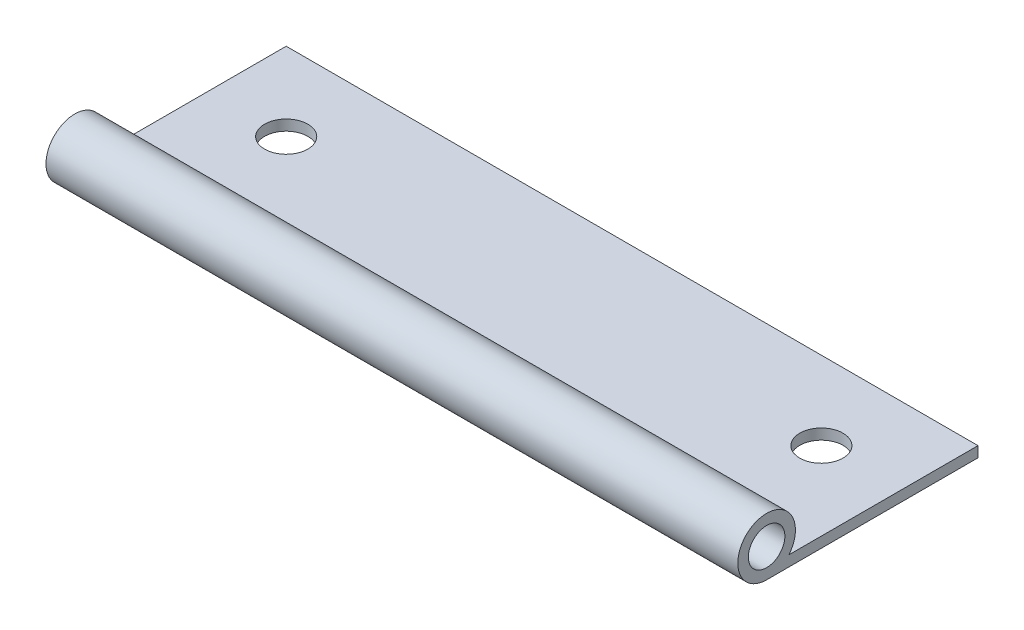
ISO-10303-21;
HEADER;
FILE_DESCRIPTION(('STEP AP214'),'2;1');
FILE_NAME('part.step','',(''),(''),'','','');
FILE_SCHEMA(('AUTOMOTIVE_DESIGN { 1 0 10303 214 1 1 1 1 }'));
ENDSEC;
DATA;
#1=APPLICATION_CONTEXT('core data for automotive mechanical design processes');
#2=APPLICATION_PROTOCOL_DEFINITION('international standard','automotive_design',2000,#1);
#3=PRODUCT_CONTEXT('',#1,'mechanical');
#4=PRODUCT('Part','Part','',(#3));
#5=PRODUCT_RELATED_PRODUCT_CATEGORY('part','',(#4));
#6=PRODUCT_DEFINITION_FORMATION('','',#4);
#7=PRODUCT_DEFINITION_CONTEXT('part definition',#1,'design');
#8=PRODUCT_DEFINITION('design','',#6,#7);
#9=PRODUCT_DEFINITION_SHAPE('','',#8);
#10=(LENGTH_UNIT() NAMED_UNIT(*) SI_UNIT(.MILLI.,.METRE.));
#11=(NAMED_UNIT(*) PLANE_ANGLE_UNIT() SI_UNIT($,.RADIAN.));
#12=(NAMED_UNIT(*) SI_UNIT($,.STERADIAN.) SOLID_ANGLE_UNIT());
#13=UNCERTAINTY_MEASURE_WITH_UNIT(LENGTH_MEASURE(1.E-05),#10,'distance_accuracy_value','');
#14=(GEOMETRIC_REPRESENTATION_CONTEXT(3) GLOBAL_UNCERTAINTY_ASSIGNED_CONTEXT((#13)) GLOBAL_UNIT_ASSIGNED_CONTEXT((#10,
#11,#12)) REPRESENTATION_CONTEXT('',''));
#15=CARTESIAN_POINT('',(0.,0.,0.));
#16=DIRECTION('',(0.,0.,1.));
#17=DIRECTION('',(1.,0.,0.));
#18=AXIS2_PLACEMENT_3D('',#15,#16,#17);
#19=CARTESIAN_POINT('',(72.,1.9,3.));
#20=DIRECTION('',(1.,0.,0.));
#21=DIRECTION('',(0.,0.,-1.));
#22=AXIS2_PLACEMENT_3D('',#19,#20,#21);
#23=PLANE('',#22);
#24=DIRECTION('',(0.,0.,1.));
#25=VECTOR('',#24,1.);
#26=CARTESIAN_POINT('',(72.,0.,0.));
#27=LINE('',#26,#25);
#28=CARTESIAN_POINT('',(72.,0.,-19.));
#29=VERTEX_POINT('',#28);
#30=CARTESIAN_POINT('',(72.,0.,0.678362646751216));
#31=VERTEX_POINT('',#30);
#32=EDGE_CURVE('E49',#29,#31,#27,.T.);
#33=ORIENTED_EDGE('',*,*,#32,.T.);
#34=CARTESIAN_POINT('',(72.,1.9,3.));
#35=DIRECTION('',(1.,0.,0.));
#36=DIRECTION('',(0.,0.,-1.));
#37=AXIS2_PLACEMENT_3D('',#34,#35,#36);
#38=CIRCLE('',#37,3.);
#39=CARTESIAN_POINT('',(72.,-1.1,3.));
#40=VERTEX_POINT('',#39);
#41=EDGE_CURVE('E79',#31,#40,#38,.T.);
#42=ORIENTED_EDGE('',*,*,#41,.T.);
#43=DIRECTION('',(0.,0.,-1.));
#44=VECTOR('',#43,1.);
#45=CARTESIAN_POINT('',(72.,-1.1,0.));
#46=LINE('',#45,#44);
#47=CARTESIAN_POINT('',(72.,-1.1,-19.));
#48=VERTEX_POINT('',#47);
#49=EDGE_CURVE('E83',#40,#48,#46,.T.);
#50=ORIENTED_EDGE('',*,*,#49,.T.);
#51=DIRECTION('',(0.,1.,0.));
#52=VECTOR('',#51,1.);
#53=CARTESIAN_POINT('',(72.,0.,-19.));
#54=LINE('',#53,#52);
#55=EDGE_CURVE('E91',#48,#29,#54,.T.);
#56=ORIENTED_EDGE('',*,*,#55,.T.);
#57=EDGE_LOOP('',(#33,#42,#50,#56));
#58=FACE_BOUND('',#57,.T.);
#59=CARTESIAN_POINT('',(72.,1.9,3.));
#60=DIRECTION('',(1.,0.,0.));
#61=DIRECTION('',(0.,0.,-1.));
#62=AXIS2_PLACEMENT_3D('',#59,#60,#61);
#63=CIRCLE('',#62,1.9);
#64=CARTESIAN_POINT('',(72.,1.9,1.1));
#65=VERTEX_POINT('',#64);
#66=EDGE_CURVE('E98',#65,#65,#63,.T.);
#67=ORIENTED_EDGE('',*,*,#66,.F.);
#68=EDGE_LOOP('',(#67));
#69=FACE_BOUND('',#68,.T.);
#70=ADVANCED_FACE('F32',(#58,#69),#23,.T.);
#71=CARTESIAN_POINT('',(0.,1.9,3.));
#72=DIRECTION('',(1.,0.,0.));
#73=DIRECTION('',(0.,0.,-1.));
#74=AXIS2_PLACEMENT_3D('',#71,#72,#73);
#75=PLANE('',#74);
#76=CARTESIAN_POINT('',(0.,1.9,3.));
#77=DIRECTION('',(1.,0.,0.));
#78=DIRECTION('',(0.,0.,-1.));
#79=AXIS2_PLACEMENT_3D('',#76,#77,#78);
#80=CIRCLE('',#79,3.);
#81=CARTESIAN_POINT('',(0.,0.,0.678362646751216));
#82=VERTEX_POINT('',#81);
#83=CARTESIAN_POINT('',(0.,-1.1,3.));
#84=VERTEX_POINT('',#83);
#85=EDGE_CURVE('E87',#82,#84,#80,.T.);
#86=ORIENTED_EDGE('',*,*,#85,.F.);
#87=DIRECTION('',(0.,0.,1.));
#88=VECTOR('',#87,1.);
#89=CARTESIAN_POINT('',(0.,0.,0.));
#90=LINE('',#89,#88);
#91=CARTESIAN_POINT('',(0.,0.,-19.));
#92=VERTEX_POINT('',#91);
#93=EDGE_CURVE('E101',#92,#82,#90,.T.);
#94=ORIENTED_EDGE('',*,*,#93,.F.);
#95=DIRECTION('',(0.,1.,0.));
#96=VECTOR('',#95,1.);
#97=CARTESIAN_POINT('',(0.,0.,-19.));
#98=LINE('',#97,#96);
#99=CARTESIAN_POINT('',(0.,-1.1,-19.));
#100=VERTEX_POINT('',#99);
#101=EDGE_CURVE('E73',#100,#92,#98,.T.);
#102=ORIENTED_EDGE('',*,*,#101,.F.);
#103=DIRECTION('',(0.,0.,-1.));
#104=VECTOR('',#103,1.);
#105=CARTESIAN_POINT('',(0.,-1.1,-19.));
#106=LINE('',#105,#104);
#107=EDGE_CURVE('E66',#84,#100,#106,.T.);
#108=ORIENTED_EDGE('',*,*,#107,.F.);
#109=EDGE_LOOP('',(#86,#94,#102,#108));
#110=FACE_BOUND('',#109,.T.);
#111=CARTESIAN_POINT('',(0.,1.9,3.));
#112=DIRECTION('',(1.,0.,0.));
#113=DIRECTION('',(0.,0.,-1.));
#114=AXIS2_PLACEMENT_3D('',#111,#112,#113);
#115=CIRCLE('',#114,1.9);
#116=CARTESIAN_POINT('',(0.,1.9,1.1));
#117=VERTEX_POINT('',#116);
#118=EDGE_CURVE('E152',#117,#117,#115,.T.);
#119=ORIENTED_EDGE('',*,*,#118,.T.);
#120=EDGE_LOOP('',(#119));
#121=FACE_BOUND('',#120,.T.);
#122=ADVANCED_FACE('F107',(#110,#121),#75,.F.);
#123=CARTESIAN_POINT('',(72.,1.9,3.));
#124=DIRECTION('',(-1.,0.,0.));
#125=DIRECTION('',(0.,0.,1.));
#126=AXIS2_PLACEMENT_3D('',#123,#124,#125);
#127=CYLINDRICAL_SURFACE('',#126,3.);
#128=ORIENTED_EDGE('',*,*,#85,.T.);
#129=DIRECTION('',(-1.,0.,0.));
#130=VECTOR('',#129,1.);
#131=CARTESIAN_POINT('',(72.,-1.1,3.));
#132=LINE('',#131,#130);
#133=EDGE_CURVE('E41',#40,#84,#132,.T.);
#134=ORIENTED_EDGE('',*,*,#133,.F.);
#135=ORIENTED_EDGE('',*,*,#41,.F.);
#136=DIRECTION('',(-1.,0.,0.));
#137=VECTOR('',#136,1.);
#138=CARTESIAN_POINT('',(72.,0.,0.678362646751216));
#139=LINE('',#138,#137);
#140=EDGE_CURVE('E11',#31,#82,#139,.T.);
#141=ORIENTED_EDGE('',*,*,#140,.T.);
#142=EDGE_LOOP('',(#128,#134,#135,#141));
#143=FACE_BOUND('',#142,.T.);
#144=ADVANCED_FACE('F34',(#143),#127,.T.);
#145=CARTESIAN_POINT('',(72.,-1.1,-19.));
#146=DIRECTION('',(0.,1.,0.));
#147=DIRECTION('',(0.,0.,1.));
#148=AXIS2_PLACEMENT_3D('',#145,#146,#147);
#149=PLANE('',#148);
#150=CARTESIAN_POINT('',(63.85,-1.1,-10.85));
#151=DIRECTION('',(0.,1.,0.));
#152=DIRECTION('',(0.,0.,-1.));
#153=AXIS2_PLACEMENT_3D('',#150,#151,#152);
#154=CIRCLE('',#153,2.25);
#155=CARTESIAN_POINT('',(63.85,-1.1,-13.1));
#156=VERTEX_POINT('',#155);
#157=EDGE_CURVE('E142',#156,#156,#154,.T.);
#158=ORIENTED_EDGE('',*,*,#157,.T.);
#159=EDGE_LOOP('',(#158));
#160=FACE_BOUND('',#159,.T.);
#161=CARTESIAN_POINT('',(8.15,-1.1,-10.85));
#162=DIRECTION('',(0.,1.,0.));
#163=DIRECTION('',(0.,0.,1.));
#164=AXIS2_PLACEMENT_3D('',#161,#162,#163);
#165=CIRCLE('',#164,2.25);
#166=CARTESIAN_POINT('',(8.15,-1.1,-8.6));
#167=VERTEX_POINT('',#166);
#168=EDGE_CURVE('E149',#167,#167,#165,.T.);
#169=ORIENTED_EDGE('',*,*,#168,.T.);
#170=EDGE_LOOP('',(#169));
#171=FACE_BOUND('',#170,.T.);
#172=ORIENTED_EDGE('',*,*,#107,.T.);
#173=DIRECTION('',(-1.,0.,0.));
#174=VECTOR('',#173,1.);
#175=CARTESIAN_POINT('',(72.,-1.1,-19.));
#176=LINE('',#175,#174);
#177=EDGE_CURVE('E88',#48,#100,#176,.T.);
#178=ORIENTED_EDGE('',*,*,#177,.F.);
#179=ORIENTED_EDGE('',*,*,#49,.F.);
#180=ORIENTED_EDGE('',*,*,#133,.T.);
#181=EDGE_LOOP('',(#172,#178,#179,#180));
#182=FACE_BOUND('',#181,.T.);
#183=ADVANCED_FACE('F89',(#160,#171,#182),#149,.F.);
#184=CARTESIAN_POINT('',(72.,0.,-19.));
#185=DIRECTION('',(0.,0.,1.));
#186=DIRECTION('',(1.,0.,0.));
#187=AXIS2_PLACEMENT_3D('',#184,#185,#186);
#188=PLANE('',#187);
#189=ORIENTED_EDGE('',*,*,#101,.T.);
#190=DIRECTION('',(-1.,0.,0.));
#191=VECTOR('',#190,1.);
#192=CARTESIAN_POINT('',(72.,0.,-19.));
#193=LINE('',#192,#191);
#194=EDGE_CURVE('E93',#29,#92,#193,.T.);
#195=ORIENTED_EDGE('',*,*,#194,.F.);
#196=ORIENTED_EDGE('',*,*,#55,.F.);
#197=ORIENTED_EDGE('',*,*,#177,.T.);
#198=EDGE_LOOP('',(#189,#195,#196,#197));
#199=FACE_BOUND('',#198,.T.);
#200=ADVANCED_FACE('F104',(#199),#188,.F.);
#201=CARTESIAN_POINT('',(72.,0.,0.));
#202=DIRECTION('',(0.,-1.,0.));
#203=DIRECTION('',(0.,0.,-1.));
#204=AXIS2_PLACEMENT_3D('',#201,#202,#203);
#205=PLANE('',#204);
#206=CARTESIAN_POINT('',(63.85,0.,-10.85));
#207=DIRECTION('',(0.,1.,0.));
#208=DIRECTION('',(0.,0.,-1.));
#209=AXIS2_PLACEMENT_3D('',#206,#207,#208);
#210=CIRCLE('',#209,2.25);
#211=CARTESIAN_POINT('',(63.85,0.,-13.1));
#212=VERTEX_POINT('',#211);
#213=EDGE_CURVE('E144',#212,#212,#210,.T.);
#214=ORIENTED_EDGE('',*,*,#213,.F.);
#215=EDGE_LOOP('',(#214));
#216=FACE_BOUND('',#215,.T.);
#217=CARTESIAN_POINT('',(8.15,0.,-10.85));
#218=DIRECTION('',(0.,1.,0.));
#219=DIRECTION('',(0.,0.,1.));
#220=AXIS2_PLACEMENT_3D('',#217,#218,#219);
#221=CIRCLE('',#220,2.25);
#222=CARTESIAN_POINT('',(8.15,0.,-8.6));
#223=VERTEX_POINT('',#222);
#224=EDGE_CURVE('E146',#223,#223,#221,.T.);
#225=ORIENTED_EDGE('',*,*,#224,.F.);
#226=EDGE_LOOP('',(#225));
#227=FACE_BOUND('',#226,.T.);
#228=ORIENTED_EDGE('',*,*,#93,.T.);
#229=ORIENTED_EDGE('',*,*,#140,.F.);
#230=ORIENTED_EDGE('',*,*,#32,.F.);
#231=ORIENTED_EDGE('',*,*,#194,.T.);
#232=EDGE_LOOP('',(#228,#229,#230,#231));
#233=FACE_BOUND('',#232,.T.);
#234=ADVANCED_FACE('F109',(#216,#227,#233),#205,.F.);
#235=CARTESIAN_POINT('',(72.,1.9,3.));
#236=DIRECTION('',(-1.,0.,0.));
#237=DIRECTION('',(0.,0.,1.));
#238=AXIS2_PLACEMENT_3D('',#235,#236,#237);
#239=CYLINDRICAL_SURFACE('',#238,1.9);
#240=ORIENTED_EDGE('',*,*,#66,.T.);
#241=EDGE_LOOP('',(#240));
#242=FACE_BOUND('',#241,.T.);
#243=ORIENTED_EDGE('',*,*,#118,.F.);
#244=EDGE_LOOP('',(#243));
#245=FACE_BOUND('',#244,.T.);
#246=ADVANCED_FACE('F111',(#242,#245),#239,.F.);
#247=CARTESIAN_POINT('',(8.15,-1.1,-10.85));
#248=DIRECTION('',(0.,1.,0.));
#249=DIRECTION('',(0.,0.,1.));
#250=AXIS2_PLACEMENT_3D('',#247,#248,#249);
#251=CYLINDRICAL_SURFACE('',#250,2.25);
#252=ORIENTED_EDGE('',*,*,#168,.F.);
#253=EDGE_LOOP('',(#252));
#254=FACE_BOUND('',#253,.T.);
#255=ORIENTED_EDGE('',*,*,#224,.T.);
#256=EDGE_LOOP('',(#255));
#257=FACE_BOUND('',#256,.T.);
#258=ADVANCED_FACE('F118',(#254,#257),#251,.F.);
#259=CARTESIAN_POINT('',(63.85,-1.1,-10.85));
#260=DIRECTION('',(0.,1.,0.));
#261=DIRECTION('',(0.,0.,1.));
#262=AXIS2_PLACEMENT_3D('',#259,#260,#261);
#263=CYLINDRICAL_SURFACE('',#262,2.25);
#264=ORIENTED_EDGE('',*,*,#157,.F.);
#265=EDGE_LOOP('',(#264));
#266=FACE_BOUND('',#265,.T.);
#267=ORIENTED_EDGE('',*,*,#213,.T.);
#268=EDGE_LOOP('',(#267));
#269=FACE_BOUND('',#268,.T.);
#270=ADVANCED_FACE('F133',(#266,#269),#263,.F.);
#271=CLOSED_SHELL('',(#70,#122,#144,#183,#200,#234,#246,#258,#270));
#272=MANIFOLD_SOLID_BREP('B2',#271);
#273=ADVANCED_BREP_SHAPE_REPRESENTATION('',(#18,#272),#14);
#274=SHAPE_DEFINITION_REPRESENTATION(#9,#273);
ENDSEC;
END-ISO-10303-21;
